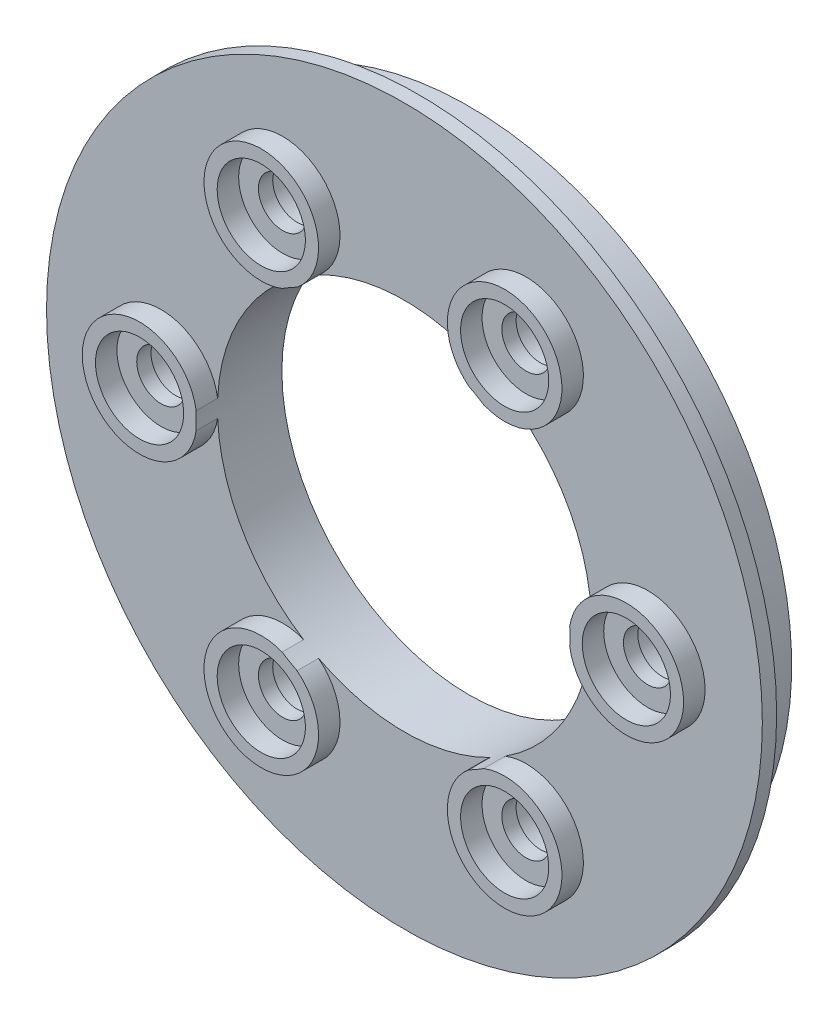
ISO-10303-21;
HEADER;
FILE_DESCRIPTION(('STEP AP214'),'2;1');
FILE_NAME('part.step','',(''),(''),'','','');
FILE_SCHEMA(('AUTOMOTIVE_DESIGN { 1 0 10303 214 1 1 1 1 }'));
ENDSEC;
DATA;
#1=APPLICATION_CONTEXT('core data for automotive mechanical design processes');
#2=APPLICATION_PROTOCOL_DEFINITION('international standard','automotive_design',2000,#1);
#3=PRODUCT_CONTEXT('',#1,'mechanical');
#4=PRODUCT('Part','Part','',(#3));
#5=PRODUCT_RELATED_PRODUCT_CATEGORY('part','',(#4));
#6=PRODUCT_DEFINITION_FORMATION('','',#4);
#7=PRODUCT_DEFINITION_CONTEXT('part definition',#1,'design');
#8=PRODUCT_DEFINITION('design','',#6,#7);
#9=PRODUCT_DEFINITION_SHAPE('','',#8);
#10=(LENGTH_UNIT() NAMED_UNIT(*) SI_UNIT(.MILLI.,.METRE.));
#11=(NAMED_UNIT(*) PLANE_ANGLE_UNIT() SI_UNIT($,.RADIAN.));
#12=(NAMED_UNIT(*) SI_UNIT($,.STERADIAN.) SOLID_ANGLE_UNIT());
#13=UNCERTAINTY_MEASURE_WITH_UNIT(LENGTH_MEASURE(1.E-05),#10,'distance_accuracy_value','');
#14=(GEOMETRIC_REPRESENTATION_CONTEXT(3) GLOBAL_UNCERTAINTY_ASSIGNED_CONTEXT((#13)) GLOBAL_UNIT_ASSIGNED_CONTEXT((#10,
#11,#12)) REPRESENTATION_CONTEXT('',''));
#15=CARTESIAN_POINT('',(0.,0.,0.));
#16=DIRECTION('',(0.,0.,1.));
#17=DIRECTION('',(1.,0.,0.));
#18=AXIS2_PLACEMENT_3D('',#15,#16,#17);
#19=CARTESIAN_POINT('',(0.,0.,-29.));
#20=DIRECTION('',(0.,0.,1.));
#21=DIRECTION('',(1.,0.,0.));
#22=AXIS2_PLACEMENT_3D('',#19,#20,#21);
#23=CYLINDRICAL_SURFACE('',#22,22.55);
#24=CARTESIAN_POINT('',(0.,0.,-23.));
#25=DIRECTION('',(0.,0.,-1.));
#26=DIRECTION('',(-1.,0.,0.));
#27=AXIS2_PLACEMENT_3D('',#24,#25,#26);
#28=CIRCLE('',#27,22.55);
#29=CARTESIAN_POINT('',(-22.55,0.,-23.));
#30=VERTEX_POINT('',#29);
#31=EDGE_CURVE('E163',#30,#30,#28,.T.);
#32=ORIENTED_EDGE('',*,*,#31,.T.);
#33=EDGE_LOOP('',(#32));
#34=FACE_BOUND('',#33,.T.);
#35=CARTESIAN_POINT('',(0.,0.,-26.5));
#36=DIRECTION('',(0.,0.,-1.));
#37=DIRECTION('',(-1.,0.,0.));
#38=AXIS2_PLACEMENT_3D('',#35,#36,#37);
#39=CIRCLE('',#38,22.55);
#40=CARTESIAN_POINT('',(-22.55,0.,-26.5));
#41=VERTEX_POINT('',#40);
#42=EDGE_CURVE('E471',#41,#41,#39,.T.);
#43=ORIENTED_EDGE('',*,*,#42,.F.);
#44=EDGE_LOOP('',(#43));
#45=FACE_BOUND('',#44,.T.);
#46=ADVANCED_FACE('F40',(#34,#45),#23,.T.);
#47=CARTESIAN_POINT('',(8.5,-14.7224318643355,-20.5));
#48=DIRECTION('',(0.,0.,-1.));
#49=DIRECTION('',(-1.,0.,0.));
#50=AXIS2_PLACEMENT_3D('',#47,#48,#49);
#51=CYLINDRICAL_SURFACE('',#50,2.25);
#52=CARTESIAN_POINT('',(8.5,-14.7224318643355,-23.));
#53=DIRECTION('',(0.,0.,-1.));
#54=DIRECTION('',(-1.,0.,0.));
#55=AXIS2_PLACEMENT_3D('',#52,#53,#54);
#56=CIRCLE('',#55,2.25);
#57=CARTESIAN_POINT('',(6.25,-14.7224318643355,-23.));
#58=VERTEX_POINT('',#57);
#59=EDGE_CURVE('E321',#58,#58,#56,.T.);
#60=ORIENTED_EDGE('',*,*,#59,.F.);
#61=EDGE_LOOP('',(#60));
#62=FACE_BOUND('',#61,.T.);
#63=CARTESIAN_POINT('',(8.5,-14.7224318643355,-26.5));
#64=DIRECTION('',(0.,0.,-1.));
#65=DIRECTION('',(-1.,0.,0.));
#66=AXIS2_PLACEMENT_3D('',#63,#64,#65);
#67=CIRCLE('',#66,2.25);
#68=CARTESIAN_POINT('',(6.25,-14.7224318643355,-26.5));
#69=VERTEX_POINT('',#68);
#70=EDGE_CURVE('E145',#69,#69,#67,.F.);
#71=ORIENTED_EDGE('',*,*,#70,.F.);
#72=EDGE_LOOP('',(#71));
#73=FACE_BOUND('',#72,.T.);
#74=ADVANCED_FACE('F395',(#62,#73),#51,.F.);
#75=CARTESIAN_POINT('',(-8.5,-14.7224318643355,-20.5));
#76=DIRECTION('',(0.,0.,-1.));
#77=DIRECTION('',(-1.,0.,0.));
#78=AXIS2_PLACEMENT_3D('',#75,#76,#77);
#79=CYLINDRICAL_SURFACE('',#78,2.25);
#80=CARTESIAN_POINT('',(-8.5,-14.7224318643355,-23.));
#81=DIRECTION('',(0.,0.,-1.));
#82=DIRECTION('',(-1.,0.,0.));
#83=AXIS2_PLACEMENT_3D('',#80,#81,#82);
#84=CIRCLE('',#83,2.25);
#85=CARTESIAN_POINT('',(-10.75,-14.7224318643355,-23.));
#86=VERTEX_POINT('',#85);
#87=EDGE_CURVE('E306',#86,#86,#84,.T.);
#88=ORIENTED_EDGE('',*,*,#87,.F.);
#89=EDGE_LOOP('',(#88));
#90=FACE_BOUND('',#89,.T.);
#91=CARTESIAN_POINT('',(-8.5,-14.7224318643355,-26.5));
#92=DIRECTION('',(0.,0.,-1.));
#93=DIRECTION('',(-1.,0.,0.));
#94=AXIS2_PLACEMENT_3D('',#91,#92,#93);
#95=CIRCLE('',#94,2.25);
#96=CARTESIAN_POINT('',(-10.75,-14.7224318643355,-26.5));
#97=VERTEX_POINT('',#96);
#98=EDGE_CURVE('E388',#97,#97,#95,.F.);
#99=ORIENTED_EDGE('',*,*,#98,.F.);
#100=EDGE_LOOP('',(#99));
#101=FACE_BOUND('',#100,.T.);
#102=ADVANCED_FACE('F397',(#90,#101),#79,.F.);
#103=CARTESIAN_POINT('',(-17.,0.,-20.5));
#104=DIRECTION('',(0.,0.,-1.));
#105=DIRECTION('',(-1.,0.,0.));
#106=AXIS2_PLACEMENT_3D('',#103,#104,#105);
#107=CYLINDRICAL_SURFACE('',#106,2.25);
#108=CARTESIAN_POINT('',(-17.,0.,-23.));
#109=DIRECTION('',(0.,0.,-1.));
#110=DIRECTION('',(-1.,0.,0.));
#111=AXIS2_PLACEMENT_3D('',#108,#109,#110);
#112=CIRCLE('',#111,2.25);
#113=CARTESIAN_POINT('',(-19.25,0.,-23.));
#114=VERTEX_POINT('',#113);
#115=EDGE_CURVE('E291',#114,#114,#112,.T.);
#116=ORIENTED_EDGE('',*,*,#115,.F.);
#117=EDGE_LOOP('',(#116));
#118=FACE_BOUND('',#117,.T.);
#119=CARTESIAN_POINT('',(-17.,0.,-26.5));
#120=DIRECTION('',(0.,0.,-1.));
#121=DIRECTION('',(-1.,0.,0.));
#122=AXIS2_PLACEMENT_3D('',#119,#120,#121);
#123=CIRCLE('',#122,2.25);
#124=CARTESIAN_POINT('',(-19.25,0.,-26.5));
#125=VERTEX_POINT('',#124);
#126=EDGE_CURVE('E380',#125,#125,#123,.F.);
#127=ORIENTED_EDGE('',*,*,#126,.F.);
#128=EDGE_LOOP('',(#127));
#129=FACE_BOUND('',#128,.T.);
#130=ADVANCED_FACE('F404',(#118,#129),#107,.F.);
#131=CARTESIAN_POINT('',(-8.5,14.7224318643355,-20.5));
#132=DIRECTION('',(0.,0.,-1.));
#133=DIRECTION('',(-1.,0.,0.));
#134=AXIS2_PLACEMENT_3D('',#131,#132,#133);
#135=CYLINDRICAL_SURFACE('',#134,2.25);
#136=CARTESIAN_POINT('',(-8.5,14.7224318643355,-23.));
#137=DIRECTION('',(0.,0.,-1.));
#138=DIRECTION('',(-1.,0.,0.));
#139=AXIS2_PLACEMENT_3D('',#136,#137,#138);
#140=CIRCLE('',#139,2.25);
#141=CARTESIAN_POINT('',(-10.75,14.7224318643355,-23.));
#142=VERTEX_POINT('',#141);
#143=EDGE_CURVE('E276',#142,#142,#140,.T.);
#144=ORIENTED_EDGE('',*,*,#143,.F.);
#145=EDGE_LOOP('',(#144));
#146=FACE_BOUND('',#145,.T.);
#147=CARTESIAN_POINT('',(-8.5,14.7224318643355,-26.5));
#148=DIRECTION('',(0.,0.,-1.));
#149=DIRECTION('',(-1.,0.,0.));
#150=AXIS2_PLACEMENT_3D('',#147,#148,#149);
#151=CIRCLE('',#150,2.25);
#152=CARTESIAN_POINT('',(-10.75,14.7224318643355,-26.5));
#153=VERTEX_POINT('',#152);
#154=EDGE_CURVE('E376',#153,#153,#151,.F.);
#155=ORIENTED_EDGE('',*,*,#154,.F.);
#156=EDGE_LOOP('',(#155));
#157=FACE_BOUND('',#156,.T.);
#158=ADVANCED_FACE('F370',(#146,#157),#135,.F.);
#159=CARTESIAN_POINT('',(8.5,14.7224318643355,-20.5));
#160=DIRECTION('',(0.,0.,-1.));
#161=DIRECTION('',(-1.,0.,0.));
#162=AXIS2_PLACEMENT_3D('',#159,#160,#161);
#163=CYLINDRICAL_SURFACE('',#162,2.25);
#164=CARTESIAN_POINT('',(8.5,14.7224318643355,-23.));
#165=DIRECTION('',(0.,0.,-1.));
#166=DIRECTION('',(-1.,0.,0.));
#167=AXIS2_PLACEMENT_3D('',#164,#165,#166);
#168=CIRCLE('',#167,2.25);
#169=CARTESIAN_POINT('',(6.25,14.7224318643355,-23.));
#170=VERTEX_POINT('',#169);
#171=EDGE_CURVE('E261',#170,#170,#168,.T.);
#172=ORIENTED_EDGE('',*,*,#171,.F.);
#173=EDGE_LOOP('',(#172));
#174=FACE_BOUND('',#173,.T.);
#175=CARTESIAN_POINT('',(8.5,14.7224318643355,-26.5));
#176=DIRECTION('',(0.,0.,-1.));
#177=DIRECTION('',(-1.,0.,0.));
#178=AXIS2_PLACEMENT_3D('',#175,#176,#177);
#179=CIRCLE('',#178,2.25);
#180=CARTESIAN_POINT('',(6.25,14.7224318643355,-26.5));
#181=VERTEX_POINT('',#180);
#182=EDGE_CURVE('E374',#181,#181,#179,.F.);
#183=ORIENTED_EDGE('',*,*,#182,.F.);
#184=EDGE_LOOP('',(#183));
#185=FACE_BOUND('',#184,.T.);
#186=ADVANCED_FACE('F366',(#174,#185),#163,.F.);
#187=CARTESIAN_POINT('',(17.,0.,-20.5));
#188=DIRECTION('',(0.,0.,-1.));
#189=DIRECTION('',(-1.,0.,0.));
#190=AXIS2_PLACEMENT_3D('',#187,#188,#189);
#191=CYLINDRICAL_SURFACE('',#190,2.25);
#192=CARTESIAN_POINT('',(17.,0.,-23.));
#193=DIRECTION('',(0.,0.,-1.));
#194=DIRECTION('',(-1.,0.,0.));
#195=AXIS2_PLACEMENT_3D('',#192,#193,#194);
#196=CIRCLE('',#195,2.25);
#197=CARTESIAN_POINT('',(14.75,0.,-23.));
#198=VERTEX_POINT('',#197);
#199=EDGE_CURVE('E246',#198,#198,#196,.T.);
#200=ORIENTED_EDGE('',*,*,#199,.F.);
#201=EDGE_LOOP('',(#200));
#202=FACE_BOUND('',#201,.T.);
#203=CARTESIAN_POINT('',(17.,0.,-26.5));
#204=DIRECTION('',(0.,0.,-1.));
#205=DIRECTION('',(-1.,0.,0.));
#206=AXIS2_PLACEMENT_3D('',#203,#204,#205);
#207=CIRCLE('',#206,2.25);
#208=CARTESIAN_POINT('',(14.75,0.,-26.5));
#209=VERTEX_POINT('',#208);
#210=EDGE_CURVE('E377',#209,#209,#207,.F.);
#211=ORIENTED_EDGE('',*,*,#210,.F.);
#212=EDGE_LOOP('',(#211));
#213=FACE_BOUND('',#212,.T.);
#214=ADVANCED_FACE('F369',(#202,#213),#191,.F.);
#215=CARTESIAN_POINT('',(0.,0.,-29.));
#216=DIRECTION('',(0.,0.,-1.));
#217=DIRECTION('',(-1.,0.,0.));
#218=AXIS2_PLACEMENT_3D('',#215,#216,#217);
#219=CYLINDRICAL_SURFACE('',#218,13.06);
#220=DIRECTION('',(0.,0.,-1.));
#221=VECTOR('',#220,1.);
#222=CARTESIAN_POINT('',(5.99921627979446,-11.6005605049174,-24.75));
#223=LINE('',#222,#221);
#224=CARTESIAN_POINT('',(5.99921627979446,-11.6005605049174,-22.));
#225=VERTEX_POINT('',#224);
#226=CARTESIAN_POINT('',(5.99921627979446,-11.6005605049174,-20.5));
#227=VERTEX_POINT('',#226);
#228=EDGE_CURVE('E217',#225,#227,#223,.F.);
#229=ORIENTED_EDGE('',*,*,#228,.T.);
#230=CARTESIAN_POINT('',(0.,0.,-20.5));
#231=DIRECTION('',(0.,0.,-1.));
#232=DIRECTION('',(-1.,0.,0.));
#233=AXIS2_PLACEMENT_3D('',#230,#231,#232);
#234=CIRCLE('',#233,13.06);
#235=CARTESIAN_POINT('',(7.04677195549965,-10.9957539535579,-20.5));
#236=VERTEX_POINT('',#235);
#237=EDGE_CURVE('E144',#236,#227,#234,.T.);
#238=ORIENTED_EDGE('',*,*,#237,.F.);
#239=DIRECTION('',(0.,0.,-1.));
#240=VECTOR('',#239,1.);
#241=CARTESIAN_POINT('',(7.04677195549965,-10.9957539535579,-24.75));
#242=LINE('',#241,#240);
#243=CARTESIAN_POINT('',(7.04677195549965,-10.9957539535579,-22.));
#244=VERTEX_POINT('',#243);
#245=EDGE_CURVE('E200',#236,#244,#242,.T.);
#246=ORIENTED_EDGE('',*,*,#245,.T.);
#247=CARTESIAN_POINT('',(0.,0.,-22.));
#248=DIRECTION('',(0.,0.,1.));
#249=DIRECTION('',(1.,0.,0.));
#250=AXIS2_PLACEMENT_3D('',#247,#248,#249);
#251=CIRCLE('',#250,13.06);
#252=CARTESIAN_POINT('',(13.0459882352941,-0.604806551359515,-22.));
#253=VERTEX_POINT('',#252);
#254=EDGE_CURVE('E196',#244,#253,#251,.T.);
#255=ORIENTED_EDGE('',*,*,#254,.T.);
#256=DIRECTION('',(0.,0.,-1.));
#257=VECTOR('',#256,1.);
#258=CARTESIAN_POINT('',(13.0459882352941,-0.604806551359515,-24.75));
#259=LINE('',#258,#257);
#260=CARTESIAN_POINT('',(13.0459882352941,-0.604806551359515,-20.5));
#261=VERTEX_POINT('',#260);
#262=EDGE_CURVE('E49',#253,#261,#259,.F.);
#263=ORIENTED_EDGE('',*,*,#262,.T.);
#264=CARTESIAN_POINT('',(13.0459882352941,0.604806551359515,-20.5));
#265=VERTEX_POINT('',#264);
#266=EDGE_CURVE('E203',#265,#261,#234,.T.);
#267=ORIENTED_EDGE('',*,*,#266,.F.);
#268=DIRECTION('',(0.,0.,-1.));
#269=VECTOR('',#268,1.);
#270=CARTESIAN_POINT('',(13.0459882352941,0.604806551359515,-24.75));
#271=LINE('',#270,#269);
#272=CARTESIAN_POINT('',(13.0459882352941,0.604806551359515,-22.));
#273=VERTEX_POINT('',#272);
#274=EDGE_CURVE('E11',#265,#273,#271,.T.);
#275=ORIENTED_EDGE('',*,*,#274,.T.);
#276=CARTESIAN_POINT('',(7.04677195549965,10.9957539535579,-22.));
#277=VERTEX_POINT('',#276);
#278=EDGE_CURVE('E201',#273,#277,#251,.T.);
#279=ORIENTED_EDGE('',*,*,#278,.T.);
#280=DIRECTION('',(0.,0.,-1.));
#281=VECTOR('',#280,1.);
#282=CARTESIAN_POINT('',(7.04677195549965,10.9957539535579,-24.75));
#283=LINE('',#282,#281);
#284=CARTESIAN_POINT('',(7.04677195549965,10.9957539535579,-20.5));
#285=VERTEX_POINT('',#284);
#286=EDGE_CURVE('E221',#277,#285,#283,.F.);
#287=ORIENTED_EDGE('',*,*,#286,.T.);
#288=CARTESIAN_POINT('',(5.99921627979446,11.6005605049174,-20.5));
#289=VERTEX_POINT('',#288);
#290=EDGE_CURVE('E197',#289,#285,#234,.T.);
#291=ORIENTED_EDGE('',*,*,#290,.F.);
#292=DIRECTION('',(0.,0.,-1.));
#293=VECTOR('',#292,1.);
#294=CARTESIAN_POINT('',(5.99921627979446,11.6005605049174,-24.75));
#295=LINE('',#294,#293);
#296=CARTESIAN_POINT('',(5.99921627979446,11.6005605049174,-22.));
#297=VERTEX_POINT('',#296);
#298=EDGE_CURVE('E225',#289,#297,#295,.T.);
#299=ORIENTED_EDGE('',*,*,#298,.T.);
#300=CARTESIAN_POINT('',(-5.99921627979446,11.6005605049174,-22.));
#301=VERTEX_POINT('',#300);
#302=EDGE_CURVE('E222',#297,#301,#251,.T.);
#303=ORIENTED_EDGE('',*,*,#302,.T.);
#304=DIRECTION('',(0.,0.,-1.));
#305=VECTOR('',#304,1.);
#306=CARTESIAN_POINT('',(-5.99921627979446,11.6005605049174,-24.75));
#307=LINE('',#306,#305);
#308=CARTESIAN_POINT('',(-5.99921627979446,11.6005605049174,-20.5));
#309=VERTEX_POINT('',#308);
#310=EDGE_CURVE('E227',#301,#309,#307,.F.);
#311=ORIENTED_EDGE('',*,*,#310,.T.);
#312=CARTESIAN_POINT('',(-7.04677195549965,10.9957539535579,-20.5));
#313=VERTEX_POINT('',#312);
#314=EDGE_CURVE('E190',#313,#309,#234,.T.);
#315=ORIENTED_EDGE('',*,*,#314,.F.);
#316=DIRECTION('',(0.,0.,-1.));
#317=VECTOR('',#316,1.);
#318=CARTESIAN_POINT('',(-7.04677195549965,10.9957539535579,-24.75));
#319=LINE('',#318,#317);
#320=CARTESIAN_POINT('',(-7.04677195549965,10.9957539535579,-22.));
#321=VERTEX_POINT('',#320);
#322=EDGE_CURVE('E229',#313,#321,#319,.T.);
#323=ORIENTED_EDGE('',*,*,#322,.T.);
#324=CARTESIAN_POINT('',(-13.0459882352941,0.604806551359515,-22.));
#325=VERTEX_POINT('',#324);
#326=EDGE_CURVE('E133',#321,#325,#251,.T.);
#327=ORIENTED_EDGE('',*,*,#326,.T.);
#328=DIRECTION('',(0.,0.,-1.));
#329=VECTOR('',#328,1.);
#330=CARTESIAN_POINT('',(-13.0459882352941,0.604806551359515,-24.75));
#331=LINE('',#330,#329);
#332=CARTESIAN_POINT('',(-13.0459882352941,0.604806551359515,-20.5));
#333=VERTEX_POINT('',#332);
#334=EDGE_CURVE('E126',#325,#333,#331,.F.);
#335=ORIENTED_EDGE('',*,*,#334,.T.);
#336=CARTESIAN_POINT('',(-13.0459882352941,-0.604806551359515,-20.5));
#337=VERTEX_POINT('',#336);
#338=EDGE_CURVE('E130',#337,#333,#234,.T.);
#339=ORIENTED_EDGE('',*,*,#338,.F.);
#340=DIRECTION('',(0.,0.,-1.));
#341=VECTOR('',#340,1.);
#342=CARTESIAN_POINT('',(-13.0459882352941,-0.604806551359515,-24.75));
#343=LINE('',#342,#341);
#344=CARTESIAN_POINT('',(-13.0459882352941,-0.604806551359514,-22.));
#345=VERTEX_POINT('',#344);
#346=EDGE_CURVE('E138',#337,#345,#343,.T.);
#347=ORIENTED_EDGE('',*,*,#346,.T.);
#348=CARTESIAN_POINT('',(-7.04677195549965,-10.9957539535579,-22.));
#349=VERTEX_POINT('',#348);
#350=EDGE_CURVE('E232',#345,#349,#251,.T.);
#351=ORIENTED_EDGE('',*,*,#350,.T.);
#352=DIRECTION('',(0.,0.,-1.));
#353=VECTOR('',#352,1.);
#354=CARTESIAN_POINT('',(-7.04677195549965,-10.9957539535579,-24.75));
#355=LINE('',#354,#353);
#356=CARTESIAN_POINT('',(-7.04677195549965,-10.9957539535579,-20.5));
#357=VERTEX_POINT('',#356);
#358=EDGE_CURVE('E56',#349,#357,#355,.F.);
#359=ORIENTED_EDGE('',*,*,#358,.T.);
#360=CARTESIAN_POINT('',(-5.99921627979446,-11.6005605049174,-20.5));
#361=VERTEX_POINT('',#360);
#362=EDGE_CURVE('E147',#361,#357,#234,.T.);
#363=ORIENTED_EDGE('',*,*,#362,.F.);
#364=DIRECTION('',(0.,0.,-1.));
#365=VECTOR('',#364,1.);
#366=CARTESIAN_POINT('',(-5.99921627979446,-11.6005605049174,-24.75));
#367=LINE('',#366,#365);
#368=CARTESIAN_POINT('',(-5.99921627979446,-11.6005605049174,-22.));
#369=VERTEX_POINT('',#368);
#370=EDGE_CURVE('E234',#361,#369,#367,.T.);
#371=ORIENTED_EDGE('',*,*,#370,.T.);
#372=EDGE_CURVE('E63',#369,#225,#251,.T.);
#373=ORIENTED_EDGE('',*,*,#372,.T.);
#374=EDGE_LOOP('',(#229,#238,#246,#255,#263,#267,#275,#279,#287,#291,#299,#303,#311,#315,#323,
#327,#335,#339,#347,#351,#359,#363,#371,#373));
#375=FACE_BOUND('',#374,.T.);
#376=CARTESIAN_POINT('',(0.,0.,-26.5));
#377=DIRECTION('',(0.,0.,-1.));
#378=DIRECTION('',(-1.,0.,0.));
#379=AXIS2_PLACEMENT_3D('',#376,#377,#378);
#380=CIRCLE('',#379,13.06);
#381=CARTESIAN_POINT('',(-13.06,0.,-26.5));
#382=VERTEX_POINT('',#381);
#383=EDGE_CURVE('E44',#382,#382,#380,.F.);
#384=ORIENTED_EDGE('',*,*,#383,.F.);
#385=EDGE_LOOP('',(#384));
#386=FACE_BOUND('',#385,.T.);
#387=ADVANCED_FACE('F128',(#375,#386),#219,.F.);
#388=CARTESIAN_POINT('',(12.5,-14.7224318643355,-20.5));
#389=DIRECTION('',(0.,0.,1.));
#390=DIRECTION('',(1.,0.,0.));
#391=AXIS2_PLACEMENT_3D('',#388,#389,#390);
#392=PLANE('',#391);
#393=CARTESIAN_POINT('',(8.5,-14.7224318643355,-20.5));
#394=DIRECTION('',(0.,0.,-1.));
#395=DIRECTION('',(-1.,0.,0.));
#396=AXIS2_PLACEMENT_3D('',#393,#394,#395);
#397=CIRCLE('',#396,3.08);
#398=CARTESIAN_POINT('',(5.42,-14.7224318643355,-20.5));
#399=VERTEX_POINT('',#398);
#400=EDGE_CURVE('E324',#399,#399,#397,.T.);
#401=ORIENTED_EDGE('',*,*,#400,.T.);
#402=EDGE_LOOP('',(#401));
#403=FACE_BOUND('',#402,.T.);
#404=CARTESIAN_POINT('',(8.5,-14.7224318643355,-20.5));
#405=DIRECTION('',(0.,0.,-1.));
#406=DIRECTION('',(-1.,0.,0.));
#407=AXIS2_PLACEMENT_3D('',#404,#405,#406);
#408=CIRCLE('',#407,4.);
#409=EDGE_CURVE('E153',#236,#227,#408,.T.);
#410=ORIENTED_EDGE('',*,*,#409,.F.);
#411=ORIENTED_EDGE('',*,*,#237,.T.);
#412=EDGE_LOOP('',(#410,#411));
#413=FACE_BOUND('',#412,.T.);
#414=ADVANCED_FACE('F213',(#403,#413),#392,.T.);
#415=CARTESIAN_POINT('',(-4.5,14.7224318643355,-20.5));
#416=DIRECTION('',(0.,0.,1.));
#417=DIRECTION('',(1.,0.,0.));
#418=AXIS2_PLACEMENT_3D('',#415,#416,#417);
#419=PLANE('',#418);
#420=CARTESIAN_POINT('',(-8.5,14.7224318643355,-20.5));
#421=DIRECTION('',(0.,0.,-1.));
#422=DIRECTION('',(-1.,0.,0.));
#423=AXIS2_PLACEMENT_3D('',#420,#421,#422);
#424=CIRCLE('',#423,3.08);
#425=CARTESIAN_POINT('',(-11.58,14.7224318643355,-20.5));
#426=VERTEX_POINT('',#425);
#427=EDGE_CURVE('E279',#426,#426,#424,.T.);
#428=ORIENTED_EDGE('',*,*,#427,.T.);
#429=EDGE_LOOP('',(#428));
#430=FACE_BOUND('',#429,.T.);
#431=CARTESIAN_POINT('',(-8.5,14.7224318643355,-20.5));
#432=DIRECTION('',(0.,0.,-1.));
#433=DIRECTION('',(-1.,0.,0.));
#434=AXIS2_PLACEMENT_3D('',#431,#432,#433);
#435=CIRCLE('',#434,4.);
#436=EDGE_CURVE('E150',#313,#309,#435,.T.);
#437=ORIENTED_EDGE('',*,*,#436,.F.);
#438=ORIENTED_EDGE('',*,*,#314,.T.);
#439=EDGE_LOOP('',(#437,#438));
#440=FACE_BOUND('',#439,.T.);
#441=ADVANCED_FACE('F427',(#430,#440),#419,.T.);
#442=CARTESIAN_POINT('',(-13.,0.,-20.5));
#443=DIRECTION('',(0.,0.,1.));
#444=DIRECTION('',(1.,0.,0.));
#445=AXIS2_PLACEMENT_3D('',#442,#443,#444);
#446=PLANE('',#445);
#447=CARTESIAN_POINT('',(-17.,0.,-20.5));
#448=DIRECTION('',(0.,0.,-1.));
#449=DIRECTION('',(-1.,0.,0.));
#450=AXIS2_PLACEMENT_3D('',#447,#448,#449);
#451=CIRCLE('',#450,3.08);
#452=CARTESIAN_POINT('',(-20.08,0.,-20.5));
#453=VERTEX_POINT('',#452);
#454=EDGE_CURVE('E294',#453,#453,#451,.T.);
#455=ORIENTED_EDGE('',*,*,#454,.T.);
#456=EDGE_LOOP('',(#455));
#457=FACE_BOUND('',#456,.T.);
#458=CARTESIAN_POINT('',(-17.,0.,-20.5));
#459=DIRECTION('',(0.,0.,-1.));
#460=DIRECTION('',(-1.,0.,0.));
#461=AXIS2_PLACEMENT_3D('',#458,#459,#460);
#462=CIRCLE('',#461,4.);
#463=EDGE_CURVE('E143',#337,#333,#462,.T.);
#464=ORIENTED_EDGE('',*,*,#463,.F.);
#465=ORIENTED_EDGE('',*,*,#338,.T.);
#466=EDGE_LOOP('',(#464,#465));
#467=FACE_BOUND('',#466,.T.);
#468=ADVANCED_FACE('F142',(#457,#467),#446,.T.);
#469=CARTESIAN_POINT('',(-4.5,-14.7224318643355,-20.5));
#470=DIRECTION('',(0.,0.,1.));
#471=DIRECTION('',(1.,0.,0.));
#472=AXIS2_PLACEMENT_3D('',#469,#470,#471);
#473=PLANE('',#472);
#474=CARTESIAN_POINT('',(-8.5,-14.7224318643355,-20.5));
#475=DIRECTION('',(0.,0.,-1.));
#476=DIRECTION('',(-1.,0.,0.));
#477=AXIS2_PLACEMENT_3D('',#474,#475,#476);
#478=CIRCLE('',#477,3.08);
#479=CARTESIAN_POINT('',(-11.58,-14.7224318643355,-20.5));
#480=VERTEX_POINT('',#479);
#481=EDGE_CURVE('E309',#480,#480,#478,.T.);
#482=ORIENTED_EDGE('',*,*,#481,.T.);
#483=EDGE_LOOP('',(#482));
#484=FACE_BOUND('',#483,.T.);
#485=CARTESIAN_POINT('',(-8.5,-14.7224318643355,-20.5));
#486=DIRECTION('',(0.,0.,-1.));
#487=DIRECTION('',(-1.,0.,0.));
#488=AXIS2_PLACEMENT_3D('',#485,#486,#487);
#489=CIRCLE('',#488,4.);
#490=EDGE_CURVE('E149',#361,#357,#489,.T.);
#491=ORIENTED_EDGE('',*,*,#490,.F.);
#492=ORIENTED_EDGE('',*,*,#362,.T.);
#493=EDGE_LOOP('',(#491,#492));
#494=FACE_BOUND('',#493,.T.);
#495=ADVANCED_FACE('F436',(#484,#494),#473,.T.);
#496=CARTESIAN_POINT('',(0.,0.,-23.));
#497=DIRECTION('',(0.,0.,1.));
#498=DIRECTION('',(1.,0.,0.));
#499=AXIS2_PLACEMENT_3D('',#496,#497,#498);
#500=CYLINDRICAL_SURFACE('',#499,25.);
#501=CARTESIAN_POINT('',(0.,0.,-23.));
#502=DIRECTION('',(0.,0.,1.));
#503=DIRECTION('',(1.,0.,0.));
#504=AXIS2_PLACEMENT_3D('',#501,#502,#503);
#505=CIRCLE('',#504,25.);
#506=CARTESIAN_POINT('',(25.,0.,-23.));
#507=VERTEX_POINT('',#506);
#508=EDGE_CURVE('E167',#507,#507,#505,.T.);
#509=ORIENTED_EDGE('',*,*,#508,.T.);
#510=EDGE_LOOP('',(#509));
#511=FACE_BOUND('',#510,.T.);
#512=CARTESIAN_POINT('',(0.,0.,-22.));
#513=DIRECTION('',(0.,0.,1.));
#514=DIRECTION('',(1.,0.,0.));
#515=AXIS2_PLACEMENT_3D('',#512,#513,#514);
#516=CIRCLE('',#515,25.);
#517=CARTESIAN_POINT('',(25.,0.,-22.));
#518=VERTEX_POINT('',#517);
#519=EDGE_CURVE('E162',#518,#518,#516,.T.);
#520=ORIENTED_EDGE('',*,*,#519,.F.);
#521=EDGE_LOOP('',(#520));
#522=FACE_BOUND('',#521,.T.);
#523=ADVANCED_FACE('F42',(#511,#522),#500,.T.);
#524=CARTESIAN_POINT('',(25.,0.,-23.));
#525=DIRECTION('',(0.,0.,-1.));
#526=DIRECTION('',(-1.,0.,0.));
#527=AXIS2_PLACEMENT_3D('',#524,#525,#526);
#528=PLANE('',#527);
#529=ORIENTED_EDGE('',*,*,#31,.F.);
#530=EDGE_LOOP('',(#529));
#531=FACE_BOUND('',#530,.T.);
#532=ORIENTED_EDGE('',*,*,#508,.F.);
#533=EDGE_LOOP('',(#532));
#534=FACE_BOUND('',#533,.T.);
#535=ADVANCED_FACE('F454',(#531,#534),#528,.T.);
#536=CARTESIAN_POINT('',(0.,0.,-22.));
#537=DIRECTION('',(0.,0.,1.));
#538=DIRECTION('',(1.,0.,0.));
#539=AXIS2_PLACEMENT_3D('',#536,#537,#538);
#540=PLANE('',#539);
#541=ORIENTED_EDGE('',*,*,#278,.F.);
#542=CARTESIAN_POINT('',(17.,0.,-22.));
#543=DIRECTION('',(0.,0.,1.));
#544=DIRECTION('',(1.,0.,0.));
#545=AXIS2_PLACEMENT_3D('',#542,#543,#544);
#546=CIRCLE('',#545,4.);
#547=EDGE_CURVE('E185',#253,#273,#546,.T.);
#548=ORIENTED_EDGE('',*,*,#547,.F.);
#549=ORIENTED_EDGE('',*,*,#254,.F.);
#550=CARTESIAN_POINT('',(8.5,-14.7224318643355,-22.));
#551=DIRECTION('',(0.,0.,1.));
#552=DIRECTION('',(1.,0.,0.));
#553=AXIS2_PLACEMENT_3D('',#550,#551,#552);
#554=CIRCLE('',#553,4.);
#555=EDGE_CURVE('E166',#225,#244,#554,.T.);
#556=ORIENTED_EDGE('',*,*,#555,.F.);
#557=ORIENTED_EDGE('',*,*,#372,.F.);
#558=CARTESIAN_POINT('',(-8.5,-14.7224318643355,-22.));
#559=DIRECTION('',(0.,0.,1.));
#560=DIRECTION('',(1.,0.,0.));
#561=AXIS2_PLACEMENT_3D('',#558,#559,#560);
#562=CIRCLE('',#561,4.);
#563=EDGE_CURVE('E174',#349,#369,#562,.T.);
#564=ORIENTED_EDGE('',*,*,#563,.F.);
#565=ORIENTED_EDGE('',*,*,#350,.F.);
#566=CARTESIAN_POINT('',(-17.,0.,-22.));
#567=DIRECTION('',(0.,0.,1.));
#568=DIRECTION('',(1.,0.,0.));
#569=AXIS2_PLACEMENT_3D('',#566,#567,#568);
#570=CIRCLE('',#569,4.);
#571=EDGE_CURVE('E177',#325,#345,#570,.T.);
#572=ORIENTED_EDGE('',*,*,#571,.F.);
#573=ORIENTED_EDGE('',*,*,#326,.F.);
#574=CARTESIAN_POINT('',(-8.5,14.7224318643355,-22.));
#575=DIRECTION('',(0.,0.,1.));
#576=DIRECTION('',(1.,0.,0.));
#577=AXIS2_PLACEMENT_3D('',#574,#575,#576);
#578=CIRCLE('',#577,4.);
#579=EDGE_CURVE('E179',#301,#321,#578,.T.);
#580=ORIENTED_EDGE('',*,*,#579,.F.);
#581=ORIENTED_EDGE('',*,*,#302,.F.);
#582=CARTESIAN_POINT('',(8.5,14.7224318643355,-22.));
#583=DIRECTION('',(0.,0.,1.));
#584=DIRECTION('',(1.,0.,0.));
#585=AXIS2_PLACEMENT_3D('',#582,#583,#584);
#586=CIRCLE('',#585,4.);
#587=EDGE_CURVE('E182',#277,#297,#586,.T.);
#588=ORIENTED_EDGE('',*,*,#587,.F.);
#589=EDGE_LOOP('',(#541,#548,#549,#556,#557,#564,#565,#572,#573,#580,#581,#588));
#590=FACE_BOUND('',#589,.T.);
#591=ORIENTED_EDGE('',*,*,#519,.T.);
#592=EDGE_LOOP('',(#591));
#593=FACE_BOUND('',#592,.T.);
#594=ADVANCED_FACE('F451',(#590,#593),#540,.T.);
#595=CARTESIAN_POINT('',(8.5,-14.7224318643355,-20.5));
#596=DIRECTION('',(0.,0.,-1.));
#597=DIRECTION('',(-1.,0.,0.));
#598=AXIS2_PLACEMENT_3D('',#595,#596,#597);
#599=CYLINDRICAL_SURFACE('',#598,4.);
#600=ORIENTED_EDGE('',*,*,#245,.F.);
#601=ORIENTED_EDGE('',*,*,#409,.T.);
#602=ORIENTED_EDGE('',*,*,#228,.F.);
#603=ORIENTED_EDGE('',*,*,#555,.T.);
#604=EDGE_LOOP('',(#600,#601,#602,#603));
#605=FACE_BOUND('',#604,.T.);
#606=ADVANCED_FACE('F216',(#605),#599,.T.);
#607=CARTESIAN_POINT('',(-8.5,-14.7224318643355,-20.5));
#608=DIRECTION('',(0.,0.,-1.));
#609=DIRECTION('',(-1.,0.,0.));
#610=AXIS2_PLACEMENT_3D('',#607,#608,#609);
#611=CYLINDRICAL_SURFACE('',#610,4.);
#612=ORIENTED_EDGE('',*,*,#370,.F.);
#613=ORIENTED_EDGE('',*,*,#490,.T.);
#614=ORIENTED_EDGE('',*,*,#358,.F.);
#615=ORIENTED_EDGE('',*,*,#563,.T.);
#616=EDGE_LOOP('',(#612,#613,#614,#615));
#617=FACE_BOUND('',#616,.T.);
#618=ADVANCED_FACE('F440',(#617),#611,.T.);
#619=CARTESIAN_POINT('',(-17.,0.,-20.5));
#620=DIRECTION('',(0.,0.,-1.));
#621=DIRECTION('',(-1.,0.,0.));
#622=AXIS2_PLACEMENT_3D('',#619,#620,#621);
#623=CYLINDRICAL_SURFACE('',#622,4.);
#624=ORIENTED_EDGE('',*,*,#346,.F.);
#625=ORIENTED_EDGE('',*,*,#463,.T.);
#626=ORIENTED_EDGE('',*,*,#334,.F.);
#627=ORIENTED_EDGE('',*,*,#571,.T.);
#628=EDGE_LOOP('',(#624,#625,#626,#627));
#629=FACE_BOUND('',#628,.T.);
#630=ADVANCED_FACE('F148',(#629),#623,.T.);
#631=CARTESIAN_POINT('',(-8.5,14.7224318643355,-20.5));
#632=DIRECTION('',(0.,0.,-1.));
#633=DIRECTION('',(-1.,0.,0.));
#634=AXIS2_PLACEMENT_3D('',#631,#632,#633);
#635=CYLINDRICAL_SURFACE('',#634,4.);
#636=ORIENTED_EDGE('',*,*,#322,.F.);
#637=ORIENTED_EDGE('',*,*,#436,.T.);
#638=ORIENTED_EDGE('',*,*,#310,.F.);
#639=ORIENTED_EDGE('',*,*,#579,.T.);
#640=EDGE_LOOP('',(#636,#637,#638,#639));
#641=FACE_BOUND('',#640,.T.);
#642=ADVANCED_FACE('F426',(#641),#635,.T.);
#643=CARTESIAN_POINT('',(8.5,14.7224318643355,-20.5));
#644=DIRECTION('',(0.,0.,-1.));
#645=DIRECTION('',(-1.,0.,0.));
#646=AXIS2_PLACEMENT_3D('',#643,#644,#645);
#647=CYLINDRICAL_SURFACE('',#646,4.);
#648=ORIENTED_EDGE('',*,*,#298,.F.);
#649=CARTESIAN_POINT('',(8.5,14.7224318643355,-20.5));
#650=DIRECTION('',(0.,0.,-1.));
#651=DIRECTION('',(-1.,0.,0.));
#652=AXIS2_PLACEMENT_3D('',#649,#650,#651);
#653=CIRCLE('',#652,4.);
#654=EDGE_CURVE('E156',#289,#285,#653,.T.);
#655=ORIENTED_EDGE('',*,*,#654,.T.);
#656=ORIENTED_EDGE('',*,*,#286,.F.);
#657=ORIENTED_EDGE('',*,*,#587,.T.);
#658=EDGE_LOOP('',(#648,#655,#656,#657));
#659=FACE_BOUND('',#658,.T.);
#660=ADVANCED_FACE('F331',(#659),#647,.T.);
#661=CARTESIAN_POINT('',(12.5,14.7224318643355,-20.5));
#662=DIRECTION('',(0.,0.,1.));
#663=DIRECTION('',(1.,0.,0.));
#664=AXIS2_PLACEMENT_3D('',#661,#662,#663);
#665=PLANE('',#664);
#666=ORIENTED_EDGE('',*,*,#290,.T.);
#667=ORIENTED_EDGE('',*,*,#654,.F.);
#668=EDGE_LOOP('',(#666,#667));
#669=FACE_BOUND('',#668,.T.);
#670=CARTESIAN_POINT('',(8.5,14.7224318643355,-20.5));
#671=DIRECTION('',(0.,0.,-1.));
#672=DIRECTION('',(-1.,0.,0.));
#673=AXIS2_PLACEMENT_3D('',#670,#671,#672);
#674=CIRCLE('',#673,3.08);
#675=CARTESIAN_POINT('',(5.42,14.7224318643355,-20.5));
#676=VERTEX_POINT('',#675);
#677=EDGE_CURVE('E264',#676,#676,#674,.T.);
#678=ORIENTED_EDGE('',*,*,#677,.T.);
#679=EDGE_LOOP('',(#678));
#680=FACE_BOUND('',#679,.T.);
#681=ADVANCED_FACE('F333',(#669,#680),#665,.T.);
#682=CARTESIAN_POINT('',(17.,0.,-20.5));
#683=DIRECTION('',(0.,0.,-1.));
#684=DIRECTION('',(-1.,0.,0.));
#685=AXIS2_PLACEMENT_3D('',#682,#683,#684);
#686=CYLINDRICAL_SURFACE('',#685,4.);
#687=ORIENTED_EDGE('',*,*,#274,.F.);
#688=CARTESIAN_POINT('',(17.,0.,-20.5));
#689=DIRECTION('',(0.,0.,-1.));
#690=DIRECTION('',(-1.,0.,0.));
#691=AXIS2_PLACEMENT_3D('',#688,#689,#690);
#692=CIRCLE('',#691,4.);
#693=EDGE_CURVE('E327',#265,#261,#692,.T.);
#694=ORIENTED_EDGE('',*,*,#693,.T.);
#695=ORIENTED_EDGE('',*,*,#262,.F.);
#696=ORIENTED_EDGE('',*,*,#547,.T.);
#697=EDGE_LOOP('',(#687,#694,#695,#696));
#698=FACE_BOUND('',#697,.T.);
#699=ADVANCED_FACE('F336',(#698),#686,.T.);
#700=CARTESIAN_POINT('',(21.,0.,-20.5));
#701=DIRECTION('',(0.,0.,1.));
#702=DIRECTION('',(1.,0.,0.));
#703=AXIS2_PLACEMENT_3D('',#700,#701,#702);
#704=PLANE('',#703);
#705=ORIENTED_EDGE('',*,*,#266,.T.);
#706=ORIENTED_EDGE('',*,*,#693,.F.);
#707=EDGE_LOOP('',(#705,#706));
#708=FACE_BOUND('',#707,.T.);
#709=CARTESIAN_POINT('',(17.,0.,-20.5));
#710=DIRECTION('',(0.,0.,-1.));
#711=DIRECTION('',(-1.,0.,0.));
#712=AXIS2_PLACEMENT_3D('',#709,#710,#711);
#713=CIRCLE('',#712,3.08);
#714=CARTESIAN_POINT('',(13.92,0.,-20.5));
#715=VERTEX_POINT('',#714);
#716=EDGE_CURVE('E249',#715,#715,#713,.T.);
#717=ORIENTED_EDGE('',*,*,#716,.T.);
#718=EDGE_LOOP('',(#717));
#719=FACE_BOUND('',#718,.T.);
#720=ADVANCED_FACE('F417',(#708,#719),#704,.T.);
#721=CARTESIAN_POINT('',(8.5,-14.7224318643355,-20.5));
#722=DIRECTION('',(0.,0.,-1.));
#723=DIRECTION('',(-1.,0.,0.));
#724=AXIS2_PLACEMENT_3D('',#721,#722,#723);
#725=CYLINDRICAL_SURFACE('',#724,3.08);
#726=ORIENTED_EDGE('',*,*,#400,.F.);
#727=EDGE_LOOP('',(#726));
#728=FACE_BOUND('',#727,.T.);
#729=CARTESIAN_POINT('',(8.5,-14.7224318643355,-22.));
#730=DIRECTION('',(0.,0.,-1.));
#731=DIRECTION('',(-1.,0.,0.));
#732=AXIS2_PLACEMENT_3D('',#729,#730,#731);
#733=CIRCLE('',#732,3.08);
#734=CARTESIAN_POINT('',(5.42,-14.7224318643355,-22.));
#735=VERTEX_POINT('',#734);
#736=EDGE_CURVE('E312',#735,#735,#733,.T.);
#737=ORIENTED_EDGE('',*,*,#736,.T.);
#738=EDGE_LOOP('',(#737));
#739=FACE_BOUND('',#738,.T.);
#740=ADVANCED_FACE('F414',(#728,#739),#725,.F.);
#741=CARTESIAN_POINT('',(10.75,-14.7224318643355,-23.));
#742=DIRECTION('',(0.,0.,1.));
#743=DIRECTION('',(1.,0.,0.));
#744=AXIS2_PLACEMENT_3D('',#741,#742,#743);
#745=PLANE('',#744);
#746=CARTESIAN_POINT('',(8.5,-14.7224318643355,-23.));
#747=DIRECTION('',(0.,0.,-1.));
#748=DIRECTION('',(-1.,0.,0.));
#749=AXIS2_PLACEMENT_3D('',#746,#747,#748);
#750=CIRCLE('',#749,1.7);
#751=CARTESIAN_POINT('',(6.8,-14.7224318643355,-23.));
#752=VERTEX_POINT('',#751);
#753=EDGE_CURVE('E318',#752,#752,#750,.T.);
#754=ORIENTED_EDGE('',*,*,#753,.F.);
#755=EDGE_LOOP('',(#754));
#756=FACE_BOUND('',#755,.T.);
#757=ORIENTED_EDGE('',*,*,#59,.T.);
#758=EDGE_LOOP('',(#757));
#759=FACE_BOUND('',#758,.T.);
#760=ADVANCED_FACE('F412',(#756,#759),#745,.F.);
#761=CARTESIAN_POINT('',(8.5,-14.7224318643355,-20.5));
#762=DIRECTION('',(0.,0.,-1.));
#763=DIRECTION('',(-1.,0.,0.));
#764=AXIS2_PLACEMENT_3D('',#761,#762,#763);
#765=CYLINDRICAL_SURFACE('',#764,1.7);
#766=CARTESIAN_POINT('',(8.5,-14.7224318643355,-22.));
#767=DIRECTION('',(0.,0.,-1.));
#768=DIRECTION('',(-1.,0.,0.));
#769=AXIS2_PLACEMENT_3D('',#766,#767,#768);
#770=CIRCLE('',#769,1.7);
#771=CARTESIAN_POINT('',(6.8,-14.7224318643355,-22.));
#772=VERTEX_POINT('',#771);
#773=EDGE_CURVE('E315',#772,#772,#770,.T.);
#774=ORIENTED_EDGE('',*,*,#773,.F.);
#775=EDGE_LOOP('',(#774));
#776=FACE_BOUND('',#775,.T.);
#777=ORIENTED_EDGE('',*,*,#753,.T.);
#778=EDGE_LOOP('',(#777));
#779=FACE_BOUND('',#778,.T.);
#780=ADVANCED_FACE('F556',(#776,#779),#765,.F.);
#781=CARTESIAN_POINT('',(10.2,-14.7224318643355,-22.));
#782=DIRECTION('',(0.,0.,-1.));
#783=DIRECTION('',(-1.,0.,0.));
#784=AXIS2_PLACEMENT_3D('',#781,#782,#783);
#785=PLANE('',#784);
#786=ORIENTED_EDGE('',*,*,#736,.F.);
#787=EDGE_LOOP('',(#786));
#788=FACE_BOUND('',#787,.T.);
#789=ORIENTED_EDGE('',*,*,#773,.T.);
#790=EDGE_LOOP('',(#789));
#791=FACE_BOUND('',#790,.T.);
#792=ADVANCED_FACE('F553',(#788,#791),#785,.F.);
#793=CARTESIAN_POINT('',(-8.5,-14.7224318643355,-20.5));
#794=DIRECTION('',(0.,0.,-1.));
#795=DIRECTION('',(-1.,0.,0.));
#796=AXIS2_PLACEMENT_3D('',#793,#794,#795);
#797=CYLINDRICAL_SURFACE('',#796,3.08);
#798=ORIENTED_EDGE('',*,*,#481,.F.);
#799=EDGE_LOOP('',(#798));
#800=FACE_BOUND('',#799,.T.);
#801=CARTESIAN_POINT('',(-8.5,-14.7224318643355,-22.));
#802=DIRECTION('',(0.,0.,-1.));
#803=DIRECTION('',(-1.,0.,0.));
#804=AXIS2_PLACEMENT_3D('',#801,#802,#803);
#805=CIRCLE('',#804,3.08);
#806=CARTESIAN_POINT('',(-11.58,-14.7224318643355,-22.));
#807=VERTEX_POINT('',#806);
#808=EDGE_CURVE('E297',#807,#807,#805,.T.);
#809=ORIENTED_EDGE('',*,*,#808,.T.);
#810=EDGE_LOOP('',(#809));
#811=FACE_BOUND('',#810,.T.);
#812=ADVANCED_FACE('F548',(#800,#811),#797,.F.);
#813=CARTESIAN_POINT('',(-6.25,-14.7224318643355,-23.));
#814=DIRECTION('',(0.,0.,1.));
#815=DIRECTION('',(1.,0.,0.));
#816=AXIS2_PLACEMENT_3D('',#813,#814,#815);
#817=PLANE('',#816);
#818=CARTESIAN_POINT('',(-8.5,-14.7224318643355,-23.));
#819=DIRECTION('',(0.,0.,-1.));
#820=DIRECTION('',(-1.,0.,0.));
#821=AXIS2_PLACEMENT_3D('',#818,#819,#820);
#822=CIRCLE('',#821,1.7);
#823=CARTESIAN_POINT('',(-10.2,-14.7224318643355,-23.));
#824=VERTEX_POINT('',#823);
#825=EDGE_CURVE('E303',#824,#824,#822,.T.);
#826=ORIENTED_EDGE('',*,*,#825,.F.);
#827=EDGE_LOOP('',(#826));
#828=FACE_BOUND('',#827,.T.);
#829=ORIENTED_EDGE('',*,*,#87,.T.);
#830=EDGE_LOOP('',(#829));
#831=FACE_BOUND('',#830,.T.);
#832=ADVANCED_FACE('F545',(#828,#831),#817,.F.);
#833=CARTESIAN_POINT('',(-8.5,-14.7224318643355,-20.5));
#834=DIRECTION('',(0.,0.,-1.));
#835=DIRECTION('',(-1.,0.,0.));
#836=AXIS2_PLACEMENT_3D('',#833,#834,#835);
#837=CYLINDRICAL_SURFACE('',#836,1.7);
#838=CARTESIAN_POINT('',(-8.5,-14.7224318643355,-22.));
#839=DIRECTION('',(0.,0.,-1.));
#840=DIRECTION('',(-1.,0.,0.));
#841=AXIS2_PLACEMENT_3D('',#838,#839,#840);
#842=CIRCLE('',#841,1.7);
#843=CARTESIAN_POINT('',(-10.2,-14.7224318643355,-22.));
#844=VERTEX_POINT('',#843);
#845=EDGE_CURVE('E300',#844,#844,#842,.T.);
#846=ORIENTED_EDGE('',*,*,#845,.F.);
#847=EDGE_LOOP('',(#846));
#848=FACE_BOUND('',#847,.T.);
#849=ORIENTED_EDGE('',*,*,#825,.T.);
#850=EDGE_LOOP('',(#849));
#851=FACE_BOUND('',#850,.T.);
#852=ADVANCED_FACE('F541',(#848,#851),#837,.F.);
#853=CARTESIAN_POINT('',(-6.8,-14.7224318643355,-22.));
#854=DIRECTION('',(0.,0.,-1.));
#855=DIRECTION('',(-1.,0.,0.));
#856=AXIS2_PLACEMENT_3D('',#853,#854,#855);
#857=PLANE('',#856);
#858=ORIENTED_EDGE('',*,*,#808,.F.);
#859=EDGE_LOOP('',(#858));
#860=FACE_BOUND('',#859,.T.);
#861=ORIENTED_EDGE('',*,*,#845,.T.);
#862=EDGE_LOOP('',(#861));
#863=FACE_BOUND('',#862,.T.);
#864=ADVANCED_FACE('F537',(#860,#863),#857,.F.);
#865=CARTESIAN_POINT('',(-17.,0.,-20.5));
#866=DIRECTION('',(0.,0.,-1.));
#867=DIRECTION('',(-1.,0.,0.));
#868=AXIS2_PLACEMENT_3D('',#865,#866,#867);
#869=CYLINDRICAL_SURFACE('',#868,3.08);
#870=ORIENTED_EDGE('',*,*,#454,.F.);
#871=EDGE_LOOP('',(#870));
#872=FACE_BOUND('',#871,.T.);
#873=CARTESIAN_POINT('',(-17.,0.,-22.));
#874=DIRECTION('',(0.,0.,-1.));
#875=DIRECTION('',(-1.,0.,0.));
#876=AXIS2_PLACEMENT_3D('',#873,#874,#875);
#877=CIRCLE('',#876,3.08);
#878=CARTESIAN_POINT('',(-20.08,0.,-22.));
#879=VERTEX_POINT('',#878);
#880=EDGE_CURVE('E282',#879,#879,#877,.T.);
#881=ORIENTED_EDGE('',*,*,#880,.T.);
#882=EDGE_LOOP('',(#881));
#883=FACE_BOUND('',#882,.T.);
#884=ADVANCED_FACE('F530',(#872,#883),#869,.F.);
#885=CARTESIAN_POINT('',(-14.75,0.,-23.));
#886=DIRECTION('',(0.,0.,1.));
#887=DIRECTION('',(1.,0.,0.));
#888=AXIS2_PLACEMENT_3D('',#885,#886,#887);
#889=PLANE('',#888);
#890=CARTESIAN_POINT('',(-17.,0.,-23.));
#891=DIRECTION('',(0.,0.,-1.));
#892=DIRECTION('',(-1.,0.,0.));
#893=AXIS2_PLACEMENT_3D('',#890,#891,#892);
#894=CIRCLE('',#893,1.7);
#895=CARTESIAN_POINT('',(-18.7,0.,-23.));
#896=VERTEX_POINT('',#895);
#897=EDGE_CURVE('E288',#896,#896,#894,.T.);
#898=ORIENTED_EDGE('',*,*,#897,.F.);
#899=EDGE_LOOP('',(#898));
#900=FACE_BOUND('',#899,.T.);
#901=ORIENTED_EDGE('',*,*,#115,.T.);
#902=EDGE_LOOP('',(#901));
#903=FACE_BOUND('',#902,.T.);
#904=ADVANCED_FACE('F526',(#900,#903),#889,.F.);
#905=CARTESIAN_POINT('',(-17.,0.,-20.5));
#906=DIRECTION('',(0.,0.,-1.));
#907=DIRECTION('',(-1.,0.,0.));
#908=AXIS2_PLACEMENT_3D('',#905,#906,#907);
#909=CYLINDRICAL_SURFACE('',#908,1.7);
#910=CARTESIAN_POINT('',(-17.,0.,-22.));
#911=DIRECTION('',(0.,0.,-1.));
#912=DIRECTION('',(-1.,0.,0.));
#913=AXIS2_PLACEMENT_3D('',#910,#911,#912);
#914=CIRCLE('',#913,1.7);
#915=CARTESIAN_POINT('',(-18.7,0.,-22.));
#916=VERTEX_POINT('',#915);
#917=EDGE_CURVE('E285',#916,#916,#914,.T.);
#918=ORIENTED_EDGE('',*,*,#917,.F.);
#919=EDGE_LOOP('',(#918));
#920=FACE_BOUND('',#919,.T.);
#921=ORIENTED_EDGE('',*,*,#897,.T.);
#922=EDGE_LOOP('',(#921));
#923=FACE_BOUND('',#922,.T.);
#924=ADVANCED_FACE('F522',(#920,#923),#909,.F.);
#925=CARTESIAN_POINT('',(-15.3,0.,-22.));
#926=DIRECTION('',(0.,0.,-1.));
#927=DIRECTION('',(-1.,0.,0.));
#928=AXIS2_PLACEMENT_3D('',#925,#926,#927);
#929=PLANE('',#928);
#930=ORIENTED_EDGE('',*,*,#880,.F.);
#931=EDGE_LOOP('',(#930));
#932=FACE_BOUND('',#931,.T.);
#933=ORIENTED_EDGE('',*,*,#917,.T.);
#934=EDGE_LOOP('',(#933));
#935=FACE_BOUND('',#934,.T.);
#936=ADVANCED_FACE('F518',(#932,#935),#929,.F.);
#937=CARTESIAN_POINT('',(-8.5,14.7224318643355,-20.5));
#938=DIRECTION('',(0.,0.,-1.));
#939=DIRECTION('',(-1.,0.,0.));
#940=AXIS2_PLACEMENT_3D('',#937,#938,#939);
#941=CYLINDRICAL_SURFACE('',#940,3.08);
#942=ORIENTED_EDGE('',*,*,#427,.F.);
#943=EDGE_LOOP('',(#942));
#944=FACE_BOUND('',#943,.T.);
#945=CARTESIAN_POINT('',(-8.5,14.7224318643355,-22.));
#946=DIRECTION('',(0.,0.,-1.));
#947=DIRECTION('',(-1.,0.,0.));
#948=AXIS2_PLACEMENT_3D('',#945,#946,#947);
#949=CIRCLE('',#948,3.08);
#950=CARTESIAN_POINT('',(-11.58,14.7224318643355,-22.));
#951=VERTEX_POINT('',#950);
#952=EDGE_CURVE('E267',#951,#951,#949,.T.);
#953=ORIENTED_EDGE('',*,*,#952,.T.);
#954=EDGE_LOOP('',(#953));
#955=FACE_BOUND('',#954,.T.);
#956=ADVANCED_FACE('F511',(#944,#955),#941,.F.);
#957=CARTESIAN_POINT('',(-6.25,14.7224318643355,-23.));
#958=DIRECTION('',(0.,0.,1.));
#959=DIRECTION('',(1.,0.,0.));
#960=AXIS2_PLACEMENT_3D('',#957,#958,#959);
#961=PLANE('',#960);
#962=CARTESIAN_POINT('',(-8.5,14.7224318643355,-23.));
#963=DIRECTION('',(0.,0.,-1.));
#964=DIRECTION('',(-1.,0.,0.));
#965=AXIS2_PLACEMENT_3D('',#962,#963,#964);
#966=CIRCLE('',#965,1.7);
#967=CARTESIAN_POINT('',(-10.2,14.7224318643355,-23.));
#968=VERTEX_POINT('',#967);
#969=EDGE_CURVE('E273',#968,#968,#966,.T.);
#970=ORIENTED_EDGE('',*,*,#969,.F.);
#971=EDGE_LOOP('',(#970));
#972=FACE_BOUND('',#971,.T.);
#973=ORIENTED_EDGE('',*,*,#143,.T.);
#974=EDGE_LOOP('',(#973));
#975=FACE_BOUND('',#974,.T.);
#976=ADVANCED_FACE('F507',(#972,#975),#961,.F.);
#977=CARTESIAN_POINT('',(-8.5,14.7224318643355,-20.5));
#978=DIRECTION('',(0.,0.,-1.));
#979=DIRECTION('',(-1.,0.,0.));
#980=AXIS2_PLACEMENT_3D('',#977,#978,#979);
#981=CYLINDRICAL_SURFACE('',#980,1.7);
#982=CARTESIAN_POINT('',(-8.5,14.7224318643355,-22.));
#983=DIRECTION('',(0.,0.,-1.));
#984=DIRECTION('',(-1.,0.,0.));
#985=AXIS2_PLACEMENT_3D('',#982,#983,#984);
#986=CIRCLE('',#985,1.7);
#987=CARTESIAN_POINT('',(-10.2,14.7224318643355,-22.));
#988=VERTEX_POINT('',#987);
#989=EDGE_CURVE('E270',#988,#988,#986,.T.);
#990=ORIENTED_EDGE('',*,*,#989,.F.);
#991=EDGE_LOOP('',(#990));
#992=FACE_BOUND('',#991,.T.);
#993=ORIENTED_EDGE('',*,*,#969,.T.);
#994=EDGE_LOOP('',(#993));
#995=FACE_BOUND('',#994,.T.);
#996=ADVANCED_FACE('F503',(#992,#995),#981,.F.);
#997=CARTESIAN_POINT('',(-6.8,14.7224318643355,-22.));
#998=DIRECTION('',(0.,0.,-1.));
#999=DIRECTION('',(-1.,0.,0.));
#1000=AXIS2_PLACEMENT_3D('',#997,#998,#999);
#1001=PLANE('',#1000);
#1002=ORIENTED_EDGE('',*,*,#952,.F.);
#1003=EDGE_LOOP('',(#1002));
#1004=FACE_BOUND('',#1003,.T.);
#1005=ORIENTED_EDGE('',*,*,#989,.T.);
#1006=EDGE_LOOP('',(#1005));
#1007=FACE_BOUND('',#1006,.T.);
#1008=ADVANCED_FACE('F344',(#1004,#1007),#1001,.F.);
#1009=CARTESIAN_POINT('',(8.5,14.7224318643355,-20.5));
#1010=DIRECTION('',(0.,0.,-1.));
#1011=DIRECTION('',(-1.,0.,0.));
#1012=AXIS2_PLACEMENT_3D('',#1009,#1010,#1011);
#1013=CYLINDRICAL_SURFACE('',#1012,3.08);
#1014=ORIENTED_EDGE('',*,*,#677,.F.);
#1015=EDGE_LOOP('',(#1014));
#1016=FACE_BOUND('',#1015,.T.);
#1017=CARTESIAN_POINT('',(8.5,14.7224318643355,-22.));
#1018=DIRECTION('',(0.,0.,-1.));
#1019=DIRECTION('',(-1.,0.,0.));
#1020=AXIS2_PLACEMENT_3D('',#1017,#1018,#1019);
#1021=CIRCLE('',#1020,3.08);
#1022=CARTESIAN_POINT('',(5.42,14.7224318643355,-22.));
#1023=VERTEX_POINT('',#1022);
#1024=EDGE_CURVE('E252',#1023,#1023,#1021,.T.);
#1025=ORIENTED_EDGE('',*,*,#1024,.T.);
#1026=EDGE_LOOP('',(#1025));
#1027=FACE_BOUND('',#1026,.T.);
#1028=ADVANCED_FACE('F340',(#1016,#1027),#1013,.F.);
#1029=CARTESIAN_POINT('',(10.75,14.7224318643355,-23.));
#1030=DIRECTION('',(0.,0.,1.));
#1031=DIRECTION('',(1.,0.,0.));
#1032=AXIS2_PLACEMENT_3D('',#1029,#1030,#1031);
#1033=PLANE('',#1032);
#1034=CARTESIAN_POINT('',(8.5,14.7224318643355,-23.));
#1035=DIRECTION('',(0.,0.,-1.));
#1036=DIRECTION('',(-1.,0.,0.));
#1037=AXIS2_PLACEMENT_3D('',#1034,#1035,#1036);
#1038=CIRCLE('',#1037,1.7);
#1039=CARTESIAN_POINT('',(6.8,14.7224318643355,-23.));
#1040=VERTEX_POINT('',#1039);
#1041=EDGE_CURVE('E258',#1040,#1040,#1038,.T.);
#1042=ORIENTED_EDGE('',*,*,#1041,.F.);
#1043=EDGE_LOOP('',(#1042));
#1044=FACE_BOUND('',#1043,.T.);
#1045=ORIENTED_EDGE('',*,*,#171,.T.);
#1046=EDGE_LOOP('',(#1045));
#1047=FACE_BOUND('',#1046,.T.);
#1048=ADVANCED_FACE('F343',(#1044,#1047),#1033,.F.);
#1049=CARTESIAN_POINT('',(8.5,14.7224318643355,-20.5));
#1050=DIRECTION('',(0.,0.,-1.));
#1051=DIRECTION('',(-1.,0.,0.));
#1052=AXIS2_PLACEMENT_3D('',#1049,#1050,#1051);
#1053=CYLINDRICAL_SURFACE('',#1052,1.7);
#1054=CARTESIAN_POINT('',(8.5,14.7224318643355,-22.));
#1055=DIRECTION('',(0.,0.,-1.));
#1056=DIRECTION('',(-1.,0.,0.));
#1057=AXIS2_PLACEMENT_3D('',#1054,#1055,#1056);
#1058=CIRCLE('',#1057,1.7);
#1059=CARTESIAN_POINT('',(6.8,14.7224318643355,-22.));
#1060=VERTEX_POINT('',#1059);
#1061=EDGE_CURVE('E255',#1060,#1060,#1058,.T.);
#1062=ORIENTED_EDGE('',*,*,#1061,.F.);
#1063=EDGE_LOOP('',(#1062));
#1064=FACE_BOUND('',#1063,.T.);
#1065=ORIENTED_EDGE('',*,*,#1041,.T.);
#1066=EDGE_LOOP('',(#1065));
#1067=FACE_BOUND('',#1066,.T.);
#1068=ADVANCED_FACE('F352',(#1064,#1067),#1053,.F.);
#1069=CARTESIAN_POINT('',(10.2,14.7224318643355,-22.));
#1070=DIRECTION('',(0.,0.,-1.));
#1071=DIRECTION('',(-1.,0.,0.));
#1072=AXIS2_PLACEMENT_3D('',#1069,#1070,#1071);
#1073=PLANE('',#1072);
#1074=ORIENTED_EDGE('',*,*,#1024,.F.);
#1075=EDGE_LOOP('',(#1074));
#1076=FACE_BOUND('',#1075,.T.);
#1077=ORIENTED_EDGE('',*,*,#1061,.T.);
#1078=EDGE_LOOP('',(#1077));
#1079=FACE_BOUND('',#1078,.T.);
#1080=ADVANCED_FACE('F348',(#1076,#1079),#1073,.F.);
#1081=CARTESIAN_POINT('',(17.,0.,-20.5));
#1082=DIRECTION('',(0.,0.,-1.));
#1083=DIRECTION('',(-1.,0.,0.));
#1084=AXIS2_PLACEMENT_3D('',#1081,#1082,#1083);
#1085=CYLINDRICAL_SURFACE('',#1084,3.08);
#1086=ORIENTED_EDGE('',*,*,#716,.F.);
#1087=EDGE_LOOP('',(#1086));
#1088=FACE_BOUND('',#1087,.T.);
#1089=CARTESIAN_POINT('',(17.,0.,-22.));
#1090=DIRECTION('',(0.,0.,-1.));
#1091=DIRECTION('',(-1.,0.,0.));
#1092=AXIS2_PLACEMENT_3D('',#1089,#1090,#1091);
#1093=CIRCLE('',#1092,3.08);
#1094=CARTESIAN_POINT('',(13.92,0.,-22.));
#1095=VERTEX_POINT('',#1094);
#1096=EDGE_CURVE('E237',#1095,#1095,#1093,.T.);
#1097=ORIENTED_EDGE('',*,*,#1096,.T.);
#1098=EDGE_LOOP('',(#1097));
#1099=FACE_BOUND('',#1098,.T.);
#1100=ADVANCED_FACE('F351',(#1088,#1099),#1085,.F.);
#1101=CARTESIAN_POINT('',(19.25,0.,-23.));
#1102=DIRECTION('',(0.,0.,1.));
#1103=DIRECTION('',(1.,0.,0.));
#1104=AXIS2_PLACEMENT_3D('',#1101,#1102,#1103);
#1105=PLANE('',#1104);
#1106=CARTESIAN_POINT('',(17.,0.,-23.));
#1107=DIRECTION('',(0.,0.,-1.));
#1108=DIRECTION('',(-1.,0.,0.));
#1109=AXIS2_PLACEMENT_3D('',#1106,#1107,#1108);
#1110=CIRCLE('',#1109,1.7);
#1111=CARTESIAN_POINT('',(15.3,0.,-23.));
#1112=VERTEX_POINT('',#1111);
#1113=EDGE_CURVE('E243',#1112,#1112,#1110,.T.);
#1114=ORIENTED_EDGE('',*,*,#1113,.F.);
#1115=EDGE_LOOP('',(#1114));
#1116=FACE_BOUND('',#1115,.T.);
#1117=ORIENTED_EDGE('',*,*,#199,.T.);
#1118=EDGE_LOOP('',(#1117));
#1119=FACE_BOUND('',#1118,.T.);
#1120=ADVANCED_FACE('F493',(#1116,#1119),#1105,.F.);
#1121=CARTESIAN_POINT('',(17.,0.,-20.5));
#1122=DIRECTION('',(0.,0.,-1.));
#1123=DIRECTION('',(-1.,0.,0.));
#1124=AXIS2_PLACEMENT_3D('',#1121,#1122,#1123);
#1125=CYLINDRICAL_SURFACE('',#1124,1.7);
#1126=CARTESIAN_POINT('',(17.,0.,-22.));
#1127=DIRECTION('',(0.,0.,-1.));
#1128=DIRECTION('',(-1.,0.,0.));
#1129=AXIS2_PLACEMENT_3D('',#1126,#1127,#1128);
#1130=CIRCLE('',#1129,1.7);
#1131=CARTESIAN_POINT('',(15.3,0.,-22.));
#1132=VERTEX_POINT('',#1131);
#1133=EDGE_CURVE('E240',#1132,#1132,#1130,.T.);
#1134=ORIENTED_EDGE('',*,*,#1133,.F.);
#1135=EDGE_LOOP('',(#1134));
#1136=FACE_BOUND('',#1135,.T.);
#1137=ORIENTED_EDGE('',*,*,#1113,.T.);
#1138=EDGE_LOOP('',(#1137));
#1139=FACE_BOUND('',#1138,.T.);
#1140=ADVANCED_FACE('F489',(#1136,#1139),#1125,.F.);
#1141=CARTESIAN_POINT('',(18.7,0.,-22.));
#1142=DIRECTION('',(0.,0.,-1.));
#1143=DIRECTION('',(-1.,0.,0.));
#1144=AXIS2_PLACEMENT_3D('',#1141,#1142,#1143);
#1145=PLANE('',#1144);
#1146=ORIENTED_EDGE('',*,*,#1096,.F.);
#1147=EDGE_LOOP('',(#1146));
#1148=FACE_BOUND('',#1147,.T.);
#1149=ORIENTED_EDGE('',*,*,#1133,.T.);
#1150=EDGE_LOOP('',(#1149));
#1151=FACE_BOUND('',#1150,.T.);
#1152=ADVANCED_FACE('F486',(#1148,#1151),#1145,.F.);
#1153=CARTESIAN_POINT('',(0.,0.,-26.5));
#1154=DIRECTION('',(0.,0.,-1.));
#1155=DIRECTION('',(-1.,0.,0.));
#1156=AXIS2_PLACEMENT_3D('',#1153,#1154,#1155);
#1157=PLANE('',#1156);
#1158=ORIENTED_EDGE('',*,*,#42,.T.);
#1159=EDGE_LOOP('',(#1158));
#1160=FACE_BOUND('',#1159,.T.);
#1161=ORIENTED_EDGE('',*,*,#383,.T.);
#1162=EDGE_LOOP('',(#1161));
#1163=FACE_BOUND('',#1162,.T.);
#1164=ORIENTED_EDGE('',*,*,#210,.T.);
#1165=EDGE_LOOP('',(#1164));
#1166=FACE_BOUND('',#1165,.T.);
#1167=ORIENTED_EDGE('',*,*,#182,.T.);
#1168=EDGE_LOOP('',(#1167));
#1169=FACE_BOUND('',#1168,.T.);
#1170=ORIENTED_EDGE('',*,*,#154,.T.);
#1171=EDGE_LOOP('',(#1170));
#1172=FACE_BOUND('',#1171,.T.);
#1173=ORIENTED_EDGE('',*,*,#126,.T.);
#1174=EDGE_LOOP('',(#1173));
#1175=FACE_BOUND('',#1174,.T.);
#1176=ORIENTED_EDGE('',*,*,#98,.T.);
#1177=EDGE_LOOP('',(#1176));
#1178=FACE_BOUND('',#1177,.T.);
#1179=ORIENTED_EDGE('',*,*,#70,.T.);
#1180=EDGE_LOOP('',(#1179));
#1181=FACE_BOUND('',#1180,.T.);
#1182=ADVANCED_FACE('F393',(#1160,#1163,#1166,#1169,#1172,#1175,#1178,#1181),#1157,.T.);
#1183=CLOSED_SHELL('',(#46,#74,#102,#130,#158,#186,#214,#387,#414,#441,#468,#495,#523,#535,#594,
#606,#618,#630,#642,#660,#681,#699,#720,#740,#760,#780,#792,#812,#832,#852,#864,#884,#904,#924,
#936,#956,#976,#996,#1008,#1028,#1048,#1068,#1080,#1100,#1120,#1140,#1152,#1182));
#1184=MANIFOLD_SOLID_BREP('B2',#1183);
#1185=ADVANCED_BREP_SHAPE_REPRESENTATION('',(#18,#1184),#14);
#1186=SHAPE_DEFINITION_REPRESENTATION(#9,#1185);
ENDSEC;
END-ISO-10303-21;
